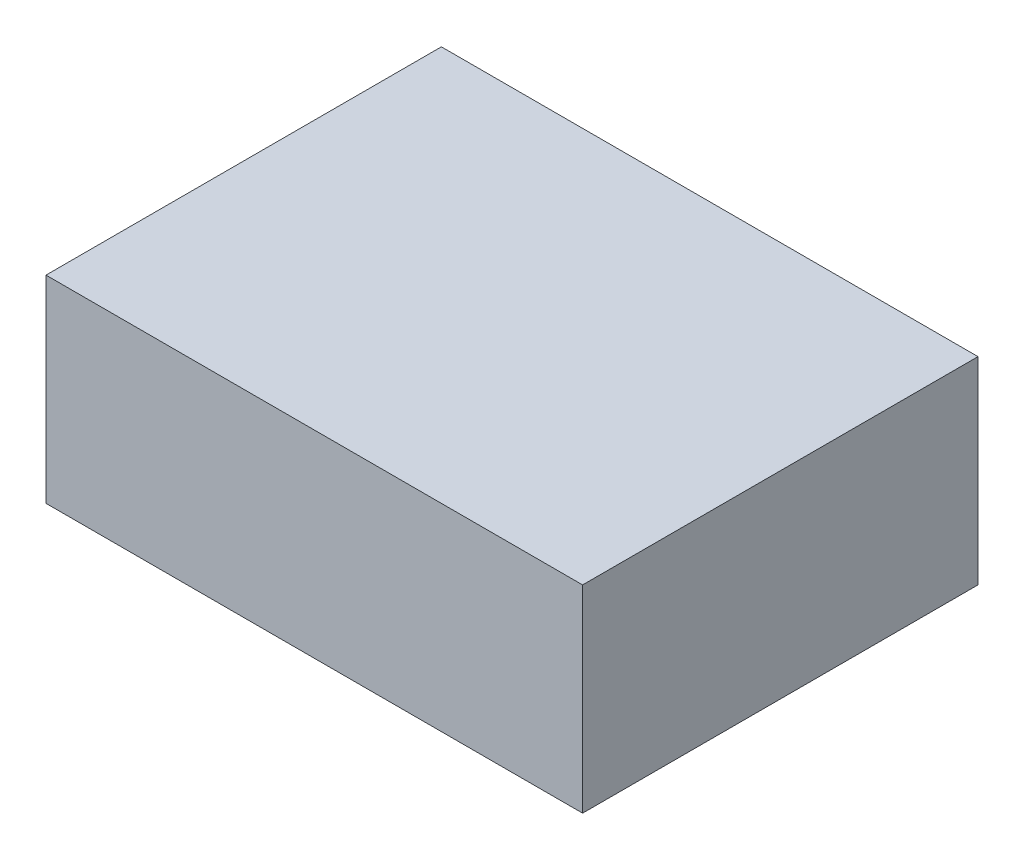
ISO-10303-21;
HEADER;
FILE_DESCRIPTION(('STEP AP214'),'2;1');
FILE_NAME('part.step','',(''),(''),'','','');
FILE_SCHEMA(('AUTOMOTIVE_DESIGN { 1 0 10303 214 1 1 1 1 }'));
ENDSEC;
DATA;
#1=APPLICATION_CONTEXT('core data for automotive mechanical design processes');
#2=APPLICATION_PROTOCOL_DEFINITION('international standard','automotive_design',2000,#1);
#3=PRODUCT_CONTEXT('',#1,'mechanical');
#4=PRODUCT('Part','Part','',(#3));
#5=PRODUCT_RELATED_PRODUCT_CATEGORY('part','',(#4));
#6=PRODUCT_DEFINITION_FORMATION('','',#4);
#7=PRODUCT_DEFINITION_CONTEXT('part definition',#1,'design');
#8=PRODUCT_DEFINITION('design','',#6,#7);
#9=PRODUCT_DEFINITION_SHAPE('','',#8);
#10=(LENGTH_UNIT() NAMED_UNIT(*) SI_UNIT(.MILLI.,.METRE.));
#11=(NAMED_UNIT(*) PLANE_ANGLE_UNIT() SI_UNIT($,.RADIAN.));
#12=(NAMED_UNIT(*) SI_UNIT($,.STERADIAN.) SOLID_ANGLE_UNIT());
#13=UNCERTAINTY_MEASURE_WITH_UNIT(LENGTH_MEASURE(1.E-05),#10,'distance_accuracy_value','');
#14=(GEOMETRIC_REPRESENTATION_CONTEXT(3) GLOBAL_UNCERTAINTY_ASSIGNED_CONTEXT((#13)) GLOBAL_UNIT_ASSIGNED_CONTEXT((#10,
#11,#12)) REPRESENTATION_CONTEXT('',''));
#15=CARTESIAN_POINT('',(0.,0.,0.));
#16=DIRECTION('',(0.,0.,1.));
#17=DIRECTION('',(1.,0.,0.));
#18=AXIS2_PLACEMENT_3D('',#15,#16,#17);
#19=CARTESIAN_POINT('',(47.5,35.,-35.));
#20=DIRECTION('',(-1.,0.,0.));
#21=DIRECTION('',(0.,0.,1.));
#22=AXIS2_PLACEMENT_3D('',#19,#20,#21);
#23=PLANE('',#22);
#24=DIRECTION('',(0.,0.,-1.));
#25=VECTOR('',#24,1.);
#26=CARTESIAN_POINT('',(47.5,0.,-35.));
#27=LINE('',#26,#25);
#28=CARTESIAN_POINT('',(47.5,0.,35.));
#29=VERTEX_POINT('',#28);
#30=CARTESIAN_POINT('',(47.5,0.,-35.));
#31=VERTEX_POINT('',#30);
#32=EDGE_CURVE('E96',#29,#31,#27,.T.);
#33=ORIENTED_EDGE('',*,*,#32,.T.);
#34=DIRECTION('',(0.,-1.,0.));
#35=VECTOR('',#34,1.);
#36=CARTESIAN_POINT('',(47.5,35.,-35.));
#37=LINE('',#36,#35);
#38=CARTESIAN_POINT('',(47.5,35.,-35.));
#39=VERTEX_POINT('',#38);
#40=EDGE_CURVE('E11',#39,#31,#37,.T.);
#41=ORIENTED_EDGE('',*,*,#40,.F.);
#42=DIRECTION('',(0.,0.,-1.));
#43=VECTOR('',#42,1.);
#44=CARTESIAN_POINT('',(47.5,35.,-35.));
#45=LINE('',#44,#43);
#46=CARTESIAN_POINT('',(47.5,35.,35.));
#47=VERTEX_POINT('',#46);
#48=EDGE_CURVE('E84',#47,#39,#45,.T.);
#49=ORIENTED_EDGE('',*,*,#48,.F.);
#50=DIRECTION('',(0.,-1.,0.));
#51=VECTOR('',#50,1.);
#52=CARTESIAN_POINT('',(47.5,35.,35.));
#53=LINE('',#52,#51);
#54=EDGE_CURVE('E92',#47,#29,#53,.T.);
#55=ORIENTED_EDGE('',*,*,#54,.T.);
#56=EDGE_LOOP('',(#33,#41,#49,#55));
#57=FACE_BOUND('',#56,.T.);
#58=ADVANCED_FACE('F33',(#57),#23,.F.);
#59=CARTESIAN_POINT('',(-47.5,35.,-35.));
#60=DIRECTION('',(0.,0.,1.));
#61=DIRECTION('',(1.,0.,0.));
#62=AXIS2_PLACEMENT_3D('',#59,#60,#61);
#63=PLANE('',#62);
#64=DIRECTION('',(-1.,0.,0.));
#65=VECTOR('',#64,1.);
#66=CARTESIAN_POINT('',(-47.5,0.,-35.));
#67=LINE('',#66,#65);
#68=CARTESIAN_POINT('',(-47.5,0.,-35.));
#69=VERTEX_POINT('',#68);
#70=EDGE_CURVE('E88',#31,#69,#67,.T.);
#71=ORIENTED_EDGE('',*,*,#70,.T.);
#72=DIRECTION('',(0.,-1.,0.));
#73=VECTOR('',#72,1.);
#74=CARTESIAN_POINT('',(-47.5,35.,-35.));
#75=LINE('',#74,#73);
#76=CARTESIAN_POINT('',(-47.5,35.,-35.));
#77=VERTEX_POINT('',#76);
#78=EDGE_CURVE('E41',#77,#69,#75,.T.);
#79=ORIENTED_EDGE('',*,*,#78,.F.);
#80=DIRECTION('',(-1.,0.,0.));
#81=VECTOR('',#80,1.);
#82=CARTESIAN_POINT('',(-47.5,35.,-35.));
#83=LINE('',#82,#81);
#84=EDGE_CURVE('E79',#39,#77,#83,.T.);
#85=ORIENTED_EDGE('',*,*,#84,.F.);
#86=ORIENTED_EDGE('',*,*,#40,.T.);
#87=EDGE_LOOP('',(#71,#79,#85,#86));
#88=FACE_BOUND('',#87,.T.);
#89=ADVANCED_FACE('F87',(#88),#63,.F.);
#90=CARTESIAN_POINT('',(-47.5,35.,-35.));
#91=DIRECTION('',(1.,0.,0.));
#92=DIRECTION('',(0.,0.,-1.));
#93=AXIS2_PLACEMENT_3D('',#90,#91,#92);
#94=PLANE('',#93);
#95=DIRECTION('',(0.,0.,1.));
#96=VECTOR('',#95,1.);
#97=CARTESIAN_POINT('',(-47.5,0.,-35.));
#98=LINE('',#97,#96);
#99=CARTESIAN_POINT('',(-47.5,0.,35.));
#100=VERTEX_POINT('',#99);
#101=EDGE_CURVE('E66',#69,#100,#98,.T.);
#102=ORIENTED_EDGE('',*,*,#101,.T.);
#103=DIRECTION('',(0.,-1.,0.));
#104=VECTOR('',#103,1.);
#105=CARTESIAN_POINT('',(-47.5,35.,35.));
#106=LINE('',#105,#104);
#107=CARTESIAN_POINT('',(-47.5,35.,35.));
#108=VERTEX_POINT('',#107);
#109=EDGE_CURVE('E89',#108,#100,#106,.T.);
#110=ORIENTED_EDGE('',*,*,#109,.F.);
#111=DIRECTION('',(0.,0.,1.));
#112=VECTOR('',#111,1.);
#113=CARTESIAN_POINT('',(-47.5,35.,-35.));
#114=LINE('',#113,#112);
#115=EDGE_CURVE('E82',#77,#108,#114,.T.);
#116=ORIENTED_EDGE('',*,*,#115,.F.);
#117=ORIENTED_EDGE('',*,*,#78,.T.);
#118=EDGE_LOOP('',(#102,#110,#116,#117));
#119=FACE_BOUND('',#118,.T.);
#120=ADVANCED_FACE('F90',(#119),#94,.F.);
#121=CARTESIAN_POINT('',(-47.5,35.,35.));
#122=DIRECTION('',(0.,0.,-1.));
#123=DIRECTION('',(-1.,0.,0.));
#124=AXIS2_PLACEMENT_3D('',#121,#122,#123);
#125=PLANE('',#124);
#126=DIRECTION('',(1.,0.,0.));
#127=VECTOR('',#126,1.);
#128=CARTESIAN_POINT('',(-47.5,0.,35.));
#129=LINE('',#128,#127);
#130=EDGE_CURVE('E72',#100,#29,#129,.T.);
#131=ORIENTED_EDGE('',*,*,#130,.T.);
#132=ORIENTED_EDGE('',*,*,#54,.F.);
#133=DIRECTION('',(1.,0.,0.));
#134=VECTOR('',#133,1.);
#135=CARTESIAN_POINT('',(-47.5,35.,35.));
#136=LINE('',#135,#134);
#137=EDGE_CURVE('E49',#108,#47,#136,.T.);
#138=ORIENTED_EDGE('',*,*,#137,.F.);
#139=ORIENTED_EDGE('',*,*,#109,.T.);
#140=EDGE_LOOP('',(#131,#132,#138,#139));
#141=FACE_BOUND('',#140,.T.);
#142=ADVANCED_FACE('F103',(#141),#125,.F.);
#143=CARTESIAN_POINT('',(0.,35.,0.));
#144=DIRECTION('',(0.,1.,0.));
#145=DIRECTION('',(0.,0.,1.));
#146=AXIS2_PLACEMENT_3D('',#143,#144,#145);
#147=PLANE('',#146);
#148=ORIENTED_EDGE('',*,*,#48,.T.);
#149=ORIENTED_EDGE('',*,*,#84,.T.);
#150=ORIENTED_EDGE('',*,*,#115,.T.);
#151=ORIENTED_EDGE('',*,*,#137,.T.);
#152=EDGE_LOOP('',(#148,#149,#150,#151));
#153=FACE_BOUND('',#152,.T.);
#154=ADVANCED_FACE('F80',(#153),#147,.T.);
#155=CARTESIAN_POINT('',(0.,0.,0.));
#156=DIRECTION('',(0.,1.,0.));
#157=DIRECTION('',(0.,0.,1.));
#158=AXIS2_PLACEMENT_3D('',#155,#156,#157);
#159=PLANE('',#158);
#160=ORIENTED_EDGE('',*,*,#32,.F.);
#161=ORIENTED_EDGE('',*,*,#130,.F.);
#162=ORIENTED_EDGE('',*,*,#101,.F.);
#163=ORIENTED_EDGE('',*,*,#70,.F.);
#164=EDGE_LOOP('',(#160,#161,#162,#163));
#165=FACE_BOUND('',#164,.T.);
#166=ADVANCED_FACE('F106',(#165),#159,.F.);
#167=CLOSED_SHELL('',(#58,#89,#120,#142,#154,#166));
#168=MANIFOLD_SOLID_BREP('B2',#167);
#169=ADVANCED_BREP_SHAPE_REPRESENTATION('',(#18,#168),#14);
#170=SHAPE_DEFINITION_REPRESENTATION(#9,#169);
ENDSEC;
END-ISO-10303-21;
